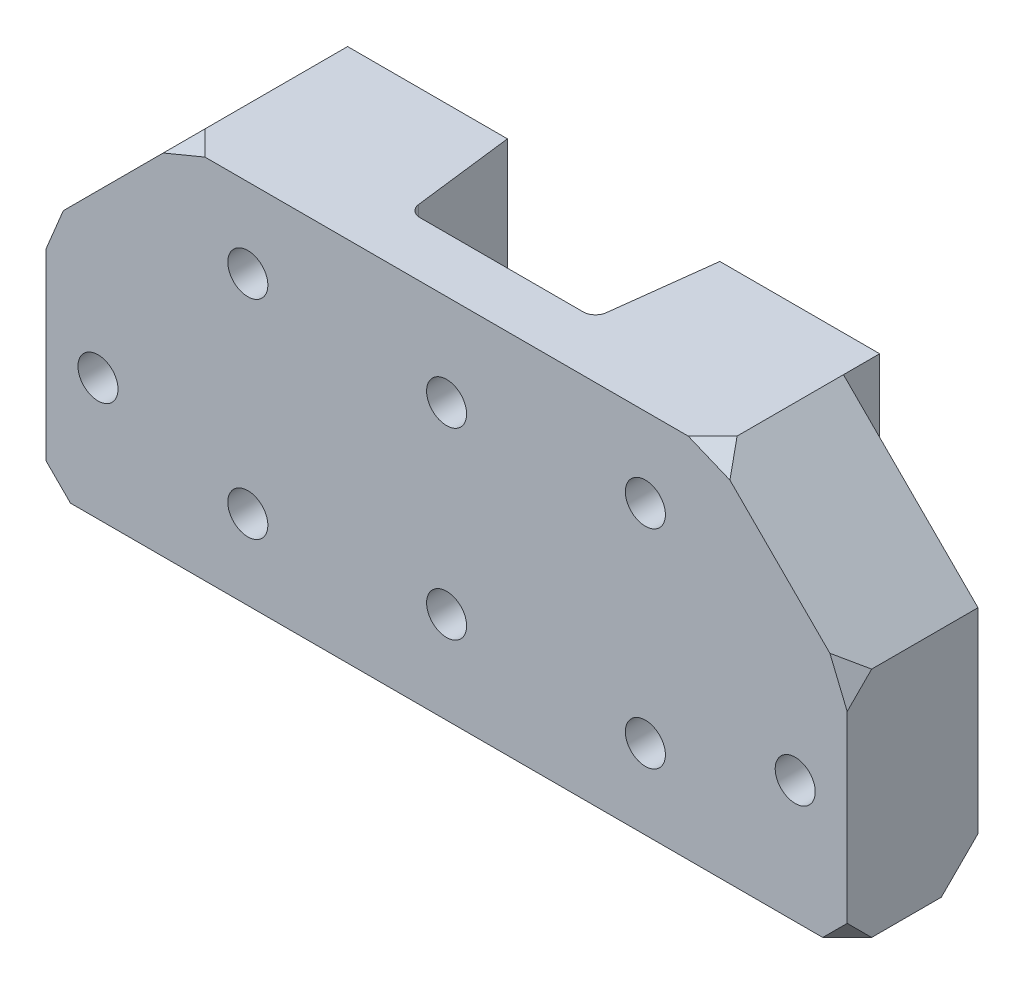
ISO-10303-21;
HEADER;
FILE_DESCRIPTION(('STEP AP214'),'2;1');
FILE_NAME('part.step','',(''),(''),'','','');
FILE_SCHEMA(('AUTOMOTIVE_DESIGN { 1 0 10303 214 1 1 1 1 }'));
ENDSEC;
DATA;
#1=APPLICATION_CONTEXT('core data for automotive mechanical design processes');
#2=APPLICATION_PROTOCOL_DEFINITION('international standard','automotive_design',2000,#1);
#3=PRODUCT_CONTEXT('',#1,'mechanical');
#4=PRODUCT('Part','Part','',(#3));
#5=PRODUCT_RELATED_PRODUCT_CATEGORY('part','',(#4));
#6=PRODUCT_DEFINITION_FORMATION('','',#4);
#7=PRODUCT_DEFINITION_CONTEXT('part definition',#1,'design');
#8=PRODUCT_DEFINITION('design','',#6,#7);
#9=PRODUCT_DEFINITION_SHAPE('','',#8);
#10=(LENGTH_UNIT() NAMED_UNIT(*) SI_UNIT(.MILLI.,.METRE.));
#11=(NAMED_UNIT(*) PLANE_ANGLE_UNIT() SI_UNIT($,.RADIAN.));
#12=(NAMED_UNIT(*) SI_UNIT($,.STERADIAN.) SOLID_ANGLE_UNIT());
#13=UNCERTAINTY_MEASURE_WITH_UNIT(LENGTH_MEASURE(1.E-05),#10,'distance_accuracy_value','');
#14=(GEOMETRIC_REPRESENTATION_CONTEXT(3) GLOBAL_UNCERTAINTY_ASSIGNED_CONTEXT((#13)) GLOBAL_UNIT_ASSIGNED_CONTEXT((#10,
#11,#12)) REPRESENTATION_CONTEXT('',''));
#15=CARTESIAN_POINT('',(0.,0.,0.));
#16=DIRECTION('',(0.,0.,1.));
#17=DIRECTION('',(1.,0.,0.));
#18=AXIS2_PLACEMENT_3D('',#15,#16,#17);
#19=CARTESIAN_POINT('',(84.1301615680965,38.,0.));
#20=DIRECTION('',(-0.707106781186546,-0.707106781186549,0.));
#21=DIRECTION('',(0.,0.,1.));
#22=AXIS2_PLACEMENT_3D('',#19,#20,#21);
#23=PLANE('',#22);
#24=DIRECTION('',(0.,0.,-1.));
#25=VECTOR('',#24,1.);
#26=CARTESIAN_POINT('',(62.1301615680964,60.,0.));
#27=LINE('',#26,#25);
#28=CARTESIAN_POINT('',(62.1301615680964,60.,33.626294368543));
#29=VERTEX_POINT('',#28);
#30=CARTESIAN_POINT('',(62.1301615680965,60.,16.2381471842715));
#31=VERTEX_POINT('',#30);
#32=EDGE_CURVE('E200',#29,#31,#27,.T.);
#33=ORIENTED_EDGE('',*,*,#32,.F.);
#34=DIRECTION('',(-0.500000000000001,0.499999999999999,-0.707106781186548));
#35=VECTOR('',#34,1.);
#36=CARTESIAN_POINT('',(61.2414711810105,60.8886903870859,32.3694963703755));
#37=LINE('',#36,#35);
#38=CARTESIAN_POINT('',(64.9585886928426,57.1715728752538,37.6262943685429));
#39=VERTEX_POINT('',#38);
#40=EDGE_CURVE('E11',#29,#39,#37,.F.);
#41=ORIENTED_EDGE('',*,*,#40,.T.);
#42=DIRECTION('',(0.707106781186549,-0.707106781186546,0.));
#43=VECTOR('',#42,1.);
#44=CARTESIAN_POINT('',(61.0650807840481,61.0650807840483,37.6262943685429));
#45=LINE('',#44,#43);
#46=CARTESIAN_POINT('',(81.3017344433503,40.8284271247462,37.6262943685429));
#47=VERTEX_POINT('',#46);
#48=EDGE_CURVE('E217',#47,#39,#45,.F.);
#49=ORIENTED_EDGE('',*,*,#48,.F.);
#50=DIRECTION('',(0.5,-0.499999999999998,-0.707106781186549));
#51=VECTOR('',#50,1.);
#52=CARTESIAN_POINT('',(96.0188519551824,26.1113096129142,16.8131471842714));
#53=LINE('',#52,#51);
#54=CARTESIAN_POINT('',(84.1301615680965,38.,33.6262943685429));
#55=VERTEX_POINT('',#54);
#56=EDGE_CURVE('E282',#55,#47,#53,.F.);
#57=ORIENTED_EDGE('',*,*,#56,.F.);
#58=DIRECTION('',(0.,0.,1.));
#59=VECTOR('',#58,1.);
#60=CARTESIAN_POINT('',(84.1301615680965,38.,0.));
#61=LINE('',#60,#59);
#62=CARTESIAN_POINT('',(84.1301615680965,38.,16.2381471842715));
#63=VERTEX_POINT('',#62);
#64=EDGE_CURVE('E235',#63,#55,#61,.T.);
#65=ORIENTED_EDGE('',*,*,#64,.F.);
#66=DIRECTION('',(-0.707106781186549,0.707106781186546,0.));
#67=VECTOR('',#66,1.);
#68=CARTESIAN_POINT('',(84.1301615680965,38.,16.2381471842715));
#69=LINE('',#68,#67);
#70=EDGE_CURVE('E209',#31,#63,#69,.F.);
#71=ORIENTED_EDGE('',*,*,#70,.F.);
#72=EDGE_LOOP('',(#33,#41,#49,#57,#65,#71));
#73=FACE_BOUND('',#72,.T.);
#74=ADVANCED_FACE('F40',(#73),#23,.F.);
#75=CARTESIAN_POINT('',(0.,0.,37.6262943685429));
#76=DIRECTION('',(0.,0.,1.));
#77=DIRECTION('',(1.,0.,0.));
#78=AXIS2_PLACEMENT_3D('',#75,#76,#77);
#79=PLANE('',#78);
#80=CARTESIAN_POINT('',(-38.3698384319035,20.,37.6262943685429));
#81=DIRECTION('',(0.,0.,1.));
#82=DIRECTION('',(1.,0.,0.));
#83=AXIS2_PLACEMENT_3D('',#80,#81,#82);
#84=CIRCLE('',#83,3.27500000000001);
#85=CARTESIAN_POINT('',(-35.0948384319035,20.,37.6262943685429));
#86=VERTEX_POINT('',#85);
#87=EDGE_CURVE('E623',#86,#86,#84,.T.);
#88=ORIENTED_EDGE('',*,*,#87,.F.);
#89=EDGE_LOOP('',(#88));
#90=FACE_BOUND('',#89,.T.);
#91=CARTESIAN_POINT('',(75.6301615680965,20.,37.6262943685429));
#92=DIRECTION('',(0.,0.,-1.));
#93=DIRECTION('',(-1.,0.,0.));
#94=AXIS2_PLACEMENT_3D('',#91,#92,#93);
#95=CIRCLE('',#94,3.27500000000001);
#96=CARTESIAN_POINT('',(72.3551615680965,20.,37.6262943685429));
#97=VERTEX_POINT('',#96);
#98=EDGE_CURVE('E548',#97,#97,#95,.T.);
#99=ORIENTED_EDGE('',*,*,#98,.T.);
#100=EDGE_LOOP('',(#99));
#101=FACE_BOUND('',#100,.T.);
#102=CARTESIAN_POINT('',(18.6301615680965,45.,37.6262943685429));
#103=DIRECTION('',(0.,0.,1.));
#104=DIRECTION('',(1.,0.,0.));
#105=AXIS2_PLACEMENT_3D('',#102,#103,#104);
#106=CIRCLE('',#105,3.275);
#107=CARTESIAN_POINT('',(21.9051615680965,45.,37.6262943685429));
#108=VERTEX_POINT('',#107);
#109=EDGE_CURVE('E564',#108,#108,#106,.T.);
#110=ORIENTED_EDGE('',*,*,#109,.F.);
#111=EDGE_LOOP('',(#110));
#112=FACE_BOUND('',#111,.T.);
#113=CARTESIAN_POINT('',(18.6301615680965,15.,37.6262943685429));
#114=DIRECTION('',(0.,0.,1.));
#115=DIRECTION('',(1.,0.,0.));
#116=AXIS2_PLACEMENT_3D('',#113,#114,#115);
#117=CIRCLE('',#116,3.275);
#118=CARTESIAN_POINT('',(21.9051615680965,15.,37.6262943685429));
#119=VERTEX_POINT('',#118);
#120=EDGE_CURVE('E563',#119,#119,#117,.T.);
#121=ORIENTED_EDGE('',*,*,#120,.F.);
#122=EDGE_LOOP('',(#121));
#123=FACE_BOUND('',#122,.T.);
#124=CARTESIAN_POINT('',(51.1301615680965,47.,37.6262943685429));
#125=DIRECTION('',(0.,0.,1.));
#126=DIRECTION('',(1.,0.,0.));
#127=AXIS2_PLACEMENT_3D('',#124,#125,#126);
#128=CIRCLE('',#127,3.275);
#129=CARTESIAN_POINT('',(54.4051615680965,47.,37.6262943685429));
#130=VERTEX_POINT('',#129);
#131=EDGE_CURVE('E583',#130,#130,#128,.T.);
#132=ORIENTED_EDGE('',*,*,#131,.F.);
#133=EDGE_LOOP('',(#132));
#134=FACE_BOUND('',#133,.T.);
#135=CARTESIAN_POINT('',(-13.8698384319035,47.,37.6262943685429));
#136=DIRECTION('',(0.,0.,1.));
#137=DIRECTION('',(1.,0.,0.));
#138=AXIS2_PLACEMENT_3D('',#135,#136,#137);
#139=CIRCLE('',#138,3.275);
#140=CARTESIAN_POINT('',(-10.5948384319035,47.,37.6262943685429));
#141=VERTEX_POINT('',#140);
#142=EDGE_CURVE('E591',#141,#141,#139,.T.);
#143=ORIENTED_EDGE('',*,*,#142,.F.);
#144=EDGE_LOOP('',(#143));
#145=FACE_BOUND('',#144,.T.);
#146=CARTESIAN_POINT('',(-13.8698384319035,13.,37.6262943685429));
#147=DIRECTION('',(0.,0.,1.));
#148=DIRECTION('',(1.,0.,0.));
#149=AXIS2_PLACEMENT_3D('',#146,#147,#148);
#150=CIRCLE('',#149,3.275);
#151=CARTESIAN_POINT('',(-10.5948384319035,13.,37.6262943685429));
#152=VERTEX_POINT('',#151);
#153=EDGE_CURVE('E587',#152,#152,#150,.T.);
#154=ORIENTED_EDGE('',*,*,#153,.F.);
#155=EDGE_LOOP('',(#154));
#156=FACE_BOUND('',#155,.T.);
#157=CARTESIAN_POINT('',(51.1301615680965,13.,37.6262943685429));
#158=DIRECTION('',(0.,0.,1.));
#159=DIRECTION('',(1.,0.,0.));
#160=AXIS2_PLACEMENT_3D('',#157,#158,#159);
#161=CIRCLE('',#160,3.275);
#162=CARTESIAN_POINT('',(54.4051615680965,13.,37.6262943685429));
#163=VERTEX_POINT('',#162);
#164=EDGE_CURVE('E579',#163,#163,#161,.T.);
#165=ORIENTED_EDGE('',*,*,#164,.F.);
#166=EDGE_LOOP('',(#165));
#167=FACE_BOUND('',#166,.T.);
#168=ORIENTED_EDGE('',*,*,#48,.T.);
#169=DIRECTION('',(-0.923879532511287,0.382683432365089,0.));
#170=VECTOR('',#169,1.);
#171=CARTESIAN_POINT('',(29.7261685015092,71.7653191537318,37.6262943685429));
#172=LINE('',#171,#170);
#173=CARTESIAN_POINT('',(58.1301615680964,60.,37.6262943685429));
#174=VERTEX_POINT('',#173);
#175=EDGE_CURVE('E49',#39,#174,#172,.T.);
#176=ORIENTED_EDGE('',*,*,#175,.T.);
#177=DIRECTION('',(-1.,0.,0.));
#178=VECTOR('',#177,1.);
#179=CARTESIAN_POINT('',(62.1301615680965,60.,37.6262943685429));
#180=LINE('',#179,#178);
#181=CARTESIAN_POINT('',(-20.8698384319036,60.,37.6262943685429));
#182=VERTEX_POINT('',#181);
#183=EDGE_CURVE('E61',#174,#182,#180,.T.);
#184=ORIENTED_EDGE('',*,*,#183,.T.);
#185=DIRECTION('',(0.923879532511287,0.38268343236509,0.));
#186=VECTOR('',#185,1.);
#187=CARTESIAN_POINT('',(-24.2695205128149,58.5918055743298,37.6262943685429));
#188=LINE('',#187,#186);
#189=CARTESIAN_POINT('',(-27.6982655566497,57.1715728752539,37.6262943685429));
#190=VERTEX_POINT('',#189);
#191=EDGE_CURVE('E311',#190,#182,#188,.T.);
#192=ORIENTED_EDGE('',*,*,#191,.F.);
#193=DIRECTION('',(0.707106781186546,0.707106781186549,0.));
#194=VECTOR('',#193,1.);
#195=CARTESIAN_POINT('',(-42.4349192159518,42.4349192159517,37.6262943685429));
#196=LINE('',#195,#194);
#197=CARTESIAN_POINT('',(-44.0414113071573,40.8284271247461,37.6262943685429));
#198=VERTEX_POINT('',#197);
#199=EDGE_CURVE('E225',#190,#198,#196,.F.);
#200=ORIENTED_EDGE('',*,*,#199,.T.);
#201=DIRECTION('',(-0.382683432365089,-0.923879532511287,0.));
#202=VECTOR('',#201,1.);
#203=CARTESIAN_POINT('',(-52.0267247902815,21.550175013987,37.6262943685429));
#204=LINE('',#203,#202);
#205=CARTESIAN_POINT('',(-46.8698384319035,33.9999999999999,37.6262943685429));
#206=VERTEX_POINT('',#205);
#207=EDGE_CURVE('E264',#198,#206,#204,.T.);
#208=ORIENTED_EDGE('',*,*,#207,.T.);
#209=DIRECTION('',(0.,-1.,0.));
#210=VECTOR('',#209,1.);
#211=CARTESIAN_POINT('',(-46.8698384319035,0.,37.6262943685429));
#212=LINE('',#211,#210);
#213=CARTESIAN_POINT('',(-46.8698384319035,3.99999999999999,37.6262943685429));
#214=VERTEX_POINT('',#213);
#215=EDGE_CURVE('E622',#206,#214,#212,.T.);
#216=ORIENTED_EDGE('',*,*,#215,.T.);
#217=DIRECTION('',(0.707106781186548,-0.707106781186547,0.));
#218=VECTOR('',#217,1.);
#219=CARTESIAN_POINT('',(-21.4349192159518,-21.4349192159518,37.6262943685429));
#220=LINE('',#219,#218);
#221=CARTESIAN_POINT('',(-42.8698384319035,0.,37.6262943685429));
#222=VERTEX_POINT('',#221);
#223=EDGE_CURVE('E253',#214,#222,#220,.T.);
#224=ORIENTED_EDGE('',*,*,#223,.T.);
#225=DIRECTION('',(1.,0.,0.));
#226=VECTOR('',#225,1.);
#227=CARTESIAN_POINT('',(-24.8698384319035,0.,37.6262943685429));
#228=LINE('',#227,#226);
#229=CARTESIAN_POINT('',(80.1301615680965,0.,37.6262943685429));
#230=VERTEX_POINT('',#229);
#231=EDGE_CURVE('E595',#222,#230,#228,.T.);
#232=ORIENTED_EDGE('',*,*,#231,.T.);
#233=DIRECTION('',(0.707106781186548,0.707106781186547,0.));
#234=VECTOR('',#233,1.);
#235=CARTESIAN_POINT('',(40.0650807840482,-40.0650807840482,37.6262943685429));
#236=LINE('',#235,#234);
#237=CARTESIAN_POINT('',(84.1301615680965,4.00000000000002,37.626294368543));
#238=VERTEX_POINT('',#237);
#239=EDGE_CURVE('E245',#230,#238,#236,.T.);
#240=ORIENTED_EDGE('',*,*,#239,.T.);
#241=DIRECTION('',(0.,-1.,0.));
#242=VECTOR('',#241,1.);
#243=CARTESIAN_POINT('',(84.1301615680965,0.,37.6262943685429));
#244=LINE('',#243,#242);
#245=CARTESIAN_POINT('',(84.1301615680965,34.,37.6262943685429));
#246=VERTEX_POINT('',#245);
#247=EDGE_CURVE('E547',#246,#238,#244,.T.);
#248=ORIENTED_EDGE('',*,*,#247,.F.);
#249=DIRECTION('',(0.38268343236509,-0.923879532511287,0.));
#250=VECTOR('',#249,1.);
#251=CARTESIAN_POINT('',(83.83039993778,34.7236885933891,37.6262943685429));
#252=LINE('',#251,#250);
#253=EDGE_CURVE('E275',#47,#246,#252,.T.);
#254=ORIENTED_EDGE('',*,*,#253,.F.);
#255=EDGE_LOOP('',(#168,#176,#184,#192,#200,#208,#216,#224,#232,#240,#248,#254));
#256=FACE_BOUND('',#255,.T.);
#257=ADVANCED_FACE('F316',(#90,#101,#112,#123,#134,#145,#156,#167,#256),#79,.T.);
#258=CARTESIAN_POINT('',(0.,60.,0.));
#259=DIRECTION('',(0.,-1.,0.));
#260=DIRECTION('',(0.,0.,-1.));
#261=AXIS2_PLACEMENT_3D('',#258,#259,#260);
#262=PLANE('',#261);
#263=DIRECTION('',(-0.707106781186548,0.,0.707106781186548));
#264=VECTOR('',#263,1.);
#265=CARTESIAN_POINT('',(47.8782279683197,60.,47.8782279683197));
#266=LINE('',#265,#264);
#267=EDGE_CURVE('E194',#29,#174,#266,.T.);
#268=ORIENTED_EDGE('',*,*,#267,.F.);
#269=ORIENTED_EDGE('',*,*,#32,.T.);
#270=DIRECTION('',(0.,0.,-1.));
#271=VECTOR('',#270,1.);
#272=CARTESIAN_POINT('',(62.1301615680965,60.,95.5324756032248));
#273=LINE('',#272,#271);
#274=CARTESIAN_POINT('',(62.1301615680965,60.,10.3131471842715));
#275=VERTEX_POINT('',#274);
#276=EDGE_CURVE('E453',#31,#275,#273,.T.);
#277=ORIENTED_EDGE('',*,*,#276,.T.);
#278=DIRECTION('',(1.,0.,0.));
#279=VECTOR('',#278,1.);
#280=CARTESIAN_POINT('',(-2.86983843190352,60.,10.3131471842715));
#281=LINE('',#280,#279);
#282=CARTESIAN_POINT('',(35.9940278876453,60.,10.3131471842715));
#283=VERTEX_POINT('',#282);
#284=EDGE_CURVE('E457',#283,#275,#281,.T.);
#285=ORIENTED_EDGE('',*,*,#284,.F.);
#286=DIRECTION('',(-0.121869343405151,0.,0.992546151641322));
#287=VECTOR('',#286,1.);
#288=CARTESIAN_POINT('',(36.970576623517,60.0000000000001,2.35979597553153));
#289=LINE('',#288,#287);
#290=CARTESIAN_POINT('',(33.961097926045,60.0000000000001,26.8700330553532));
#291=VERTEX_POINT('',#290);
#292=EDGE_CURVE('E486',#283,#291,#289,.T.);
#293=ORIENTED_EDGE('',*,*,#292,.T.);
#294=CARTESIAN_POINT('',(31.9760056227623,60.0000000000001,26.6262943685429));
#295=DIRECTION('',(0.,-1.,0.));
#296=DIRECTION('',(0.,0.,-1.));
#297=AXIS2_PLACEMENT_3D('',#294,#295,#296);
#298=CIRCLE('',#297,2.);
#299=CARTESIAN_POINT('',(31.9760056227623,60.0000000000001,28.626294368543));
#300=VERTEX_POINT('',#299);
#301=EDGE_CURVE('E489',#291,#300,#298,.T.);
#302=ORIENTED_EDGE('',*,*,#301,.T.);
#303=DIRECTION('',(-1.,0.,0.));
#304=VECTOR('',#303,1.);
#305=CARTESIAN_POINT('',(5.28431751343065,60.0000000000001,28.6262943685429));
#306=LINE('',#305,#304);
#307=CARTESIAN_POINT('',(5.28431751343065,60.0000000000001,28.6262943685429));
#308=VERTEX_POINT('',#307);
#309=EDGE_CURVE('E493',#300,#308,#306,.T.);
#310=ORIENTED_EDGE('',*,*,#309,.T.);
#311=CARTESIAN_POINT('',(5.28431751343064,60.0000000000001,26.6262943685429));
#312=DIRECTION('',(0.,-1.,0.));
#313=DIRECTION('',(0.,0.,-1.));
#314=AXIS2_PLACEMENT_3D('',#311,#312,#313);
#315=CIRCLE('',#314,2.);
#316=CARTESIAN_POINT('',(3.29922521014799,60.0000000000001,26.8700330553532));
#317=VERTEX_POINT('',#316);
#318=EDGE_CURVE('E497',#308,#317,#315,.T.);
#319=ORIENTED_EDGE('',*,*,#318,.T.);
#320=DIRECTION('',(-0.121869343405144,0.,-0.992546151641323));
#321=VECTOR('',#320,1.);
#322=CARTESIAN_POINT('',(0.298191513608607,60.0000000000001,2.42857498871066));
#323=LINE('',#322,#321);
#324=CARTESIAN_POINT('',(1.26629524854777,60.0000000000001,10.3131471842715));
#325=VERTEX_POINT('',#324);
#326=EDGE_CURVE('E501',#317,#325,#323,.T.);
#327=ORIENTED_EDGE('',*,*,#326,.T.);
#328=CARTESIAN_POINT('',(-24.8698384319035,60.,10.3131471842715));
#329=VERTEX_POINT('',#328);
#330=EDGE_CURVE('E428',#329,#325,#281,.T.);
#331=ORIENTED_EDGE('',*,*,#330,.F.);
#332=DIRECTION('',(0.,0.,-1.));
#333=VECTOR('',#332,1.);
#334=CARTESIAN_POINT('',(-24.8698384319035,60.,95.5324756032248));
#335=LINE('',#334,#333);
#336=CARTESIAN_POINT('',(-24.8698384319035,60.,16.2381471842715));
#337=VERTEX_POINT('',#336);
#338=EDGE_CURVE('E426',#337,#329,#335,.T.);
#339=ORIENTED_EDGE('',*,*,#338,.F.);
#340=DIRECTION('',(0.,0.,1.));
#341=VECTOR('',#340,1.);
#342=CARTESIAN_POINT('',(-24.8698384319035,60.,0.));
#343=LINE('',#342,#341);
#344=CARTESIAN_POINT('',(-24.8698384319035,60.,33.626294368543));
#345=VERTEX_POINT('',#344);
#346=EDGE_CURVE('E211',#337,#345,#343,.T.);
#347=ORIENTED_EDGE('',*,*,#346,.T.);
#348=DIRECTION('',(0.707106781186548,0.,0.707106781186547));
#349=VECTOR('',#348,1.);
#350=CARTESIAN_POINT('',(-29.2480664002233,60.,29.2480664002233));
#351=LINE('',#350,#349);
#352=EDGE_CURVE('E204',#345,#182,#351,.T.);
#353=ORIENTED_EDGE('',*,*,#352,.T.);
#354=ORIENTED_EDGE('',*,*,#183,.F.);
#355=EDGE_LOOP('',(#268,#269,#277,#285,#293,#302,#310,#319,#327,#331,#339,#347,#353,#354));
#356=FACE_BOUND('',#355,.T.);
#357=ADVANCED_FACE('F199',(#356),#262,.F.);
#358=CARTESIAN_POINT('',(-46.8698384319035,0.,16.2381471842715));
#359=DIRECTION('',(0.,0.,-1.));
#360=DIRECTION('',(-1.,0.,0.));
#361=AXIS2_PLACEMENT_3D('',#358,#359,#360);
#362=PLANE('',#361);
#363=CARTESIAN_POINT('',(-38.3698384319035,20.,16.2381471842715));
#364=DIRECTION('',(0.,0.,1.));
#365=DIRECTION('',(1.,0.,0.));
#366=AXIS2_PLACEMENT_3D('',#363,#364,#365);
#367=CIRCLE('',#366,3.27500000000001);
#368=CARTESIAN_POINT('',(-35.0948384319035,20.,16.2381471842715));
#369=VERTEX_POINT('',#368);
#370=EDGE_CURVE('E630',#369,#369,#367,.T.);
#371=ORIENTED_EDGE('',*,*,#370,.T.);
#372=EDGE_LOOP('',(#371));
#373=FACE_BOUND('',#372,.T.);
#374=DIRECTION('',(1.,0.,0.));
#375=VECTOR('',#374,1.);
#376=CARTESIAN_POINT('',(-46.8698384319035,0.,16.2381471842715));
#377=LINE('',#376,#375);
#378=CARTESIAN_POINT('',(-40.8698384319035,0.,16.2381471842715));
#379=VERTEX_POINT('',#378);
#380=CARTESIAN_POINT('',(-24.8698384319035,0.,16.2381471842715));
#381=VERTEX_POINT('',#380);
#382=EDGE_CURVE('E614',#379,#381,#377,.T.);
#383=ORIENTED_EDGE('',*,*,#382,.F.);
#384=DIRECTION('',(-0.707106781186547,0.707106781186548,0.));
#385=VECTOR('',#384,1.);
#386=CARTESIAN_POINT('',(-43.8698384319035,3.00000000000001,16.2381471842715));
#387=LINE('',#386,#385);
#388=CARTESIAN_POINT('',(-46.8698384319035,6.00000000000002,16.2381471842715));
#389=VERTEX_POINT('',#388);
#390=EDGE_CURVE('E300',#379,#389,#387,.T.);
#391=ORIENTED_EDGE('',*,*,#390,.T.);
#392=DIRECTION('',(0.,1.,0.));
#393=VECTOR('',#392,1.);
#394=CARTESIAN_POINT('',(-46.8698384319035,0.,16.2381471842715));
#395=LINE('',#394,#393);
#396=CARTESIAN_POINT('',(-46.8698384319035,38.,16.2381471842715));
#397=VERTEX_POINT('',#396);
#398=EDGE_CURVE('E627',#389,#397,#395,.T.);
#399=ORIENTED_EDGE('',*,*,#398,.T.);
#400=DIRECTION('',(-0.707106781186546,-0.707106781186549,0.));
#401=VECTOR('',#400,1.);
#402=CARTESIAN_POINT('',(-65.8698384319035,18.9999999999999,16.2381471842715));
#403=LINE('',#402,#401);
#404=EDGE_CURVE('E232',#397,#337,#403,.F.);
#405=ORIENTED_EDGE('',*,*,#404,.T.);
#406=DIRECTION('',(0.,1.,0.));
#407=VECTOR('',#406,1.);
#408=CARTESIAN_POINT('',(-24.8698384319035,0.,16.2381471842715));
#409=LINE('',#408,#407);
#410=EDGE_CURVE('E612',#381,#337,#409,.T.);
#411=ORIENTED_EDGE('',*,*,#410,.F.);
#412=EDGE_LOOP('',(#383,#391,#399,#405,#411));
#413=FACE_BOUND('',#412,.T.);
#414=ADVANCED_FACE('F349',(#373,#413),#362,.T.);
#415=CARTESIAN_POINT('',(12.657693959334,0.,2.96357615590343));
#416=DIRECTION('',(0.,-1.,0.));
#417=DIRECTION('',(0.,0.,-1.));
#418=AXIS2_PLACEMENT_3D('',#415,#416,#417);
#419=PLANE('',#418);
#420=DIRECTION('',(0.,0.,-1.));
#421=VECTOR('',#420,1.);
#422=CARTESIAN_POINT('',(-46.8698384319035,0.,37.6262943685429));
#423=LINE('',#422,#421);
#424=CARTESIAN_POINT('',(-46.8698384319035,0.,33.626294368543));
#425=VERTEX_POINT('',#424);
#426=CARTESIAN_POINT('',(-46.8698384319035,0.,22.2381471842715));
#427=VERTEX_POINT('',#426);
#428=EDGE_CURVE('E619',#425,#427,#423,.T.);
#429=ORIENTED_EDGE('',*,*,#428,.T.);
#430=DIRECTION('',(0.707106781186548,0.,-0.707106781186548));
#431=VECTOR('',#430,1.);
#432=CARTESIAN_POINT('',(-7.46878672210072,0.,-17.1629045255313));
#433=LINE('',#432,#431);
#434=EDGE_CURVE('E297',#427,#379,#433,.T.);
#435=ORIENTED_EDGE('',*,*,#434,.T.);
#436=ORIENTED_EDGE('',*,*,#382,.T.);
#437=DIRECTION('',(0.,0.,-1.));
#438=VECTOR('',#437,1.);
#439=CARTESIAN_POINT('',(-24.8698384319035,0.,95.5324756032248));
#440=LINE('',#439,#438);
#441=CARTESIAN_POINT('',(-24.8698384319035,0.,10.3131471842715));
#442=VERTEX_POINT('',#441);
#443=EDGE_CURVE('E434',#381,#442,#440,.T.);
#444=ORIENTED_EDGE('',*,*,#443,.T.);
#445=DIRECTION('',(1.,0.,0.));
#446=VECTOR('',#445,1.);
#447=CARTESIAN_POINT('',(-2.86983843190352,0.,10.3131471842715));
#448=LINE('',#447,#446);
#449=CARTESIAN_POINT('',(1.26629524854777,0.,10.3131471842715));
#450=VERTEX_POINT('',#449);
#451=EDGE_CURVE('E460',#442,#450,#448,.T.);
#452=ORIENTED_EDGE('',*,*,#451,.T.);
#453=DIRECTION('',(0.121869343405145,0.,0.992546151641322));
#454=VECTOR('',#453,1.);
#455=CARTESIAN_POINT('',(0.298191513608603,0.,2.42857498871065));
#456=LINE('',#455,#454);
#457=CARTESIAN_POINT('',(3.29922521014799,0.,26.8700330553532));
#458=VERTEX_POINT('',#457);
#459=EDGE_CURVE('E219',#450,#458,#456,.T.);
#460=ORIENTED_EDGE('',*,*,#459,.T.);
#461=CARTESIAN_POINT('',(5.28431751343064,0.,26.6262943685429));
#462=DIRECTION('',(0.,-1.,0.));
#463=DIRECTION('',(0.,0.,-1.));
#464=AXIS2_PLACEMENT_3D('',#461,#462,#463);
#465=CIRCLE('',#464,2.);
#466=CARTESIAN_POINT('',(5.28431751343065,0.,28.6262943685429));
#467=VERTEX_POINT('',#466);
#468=EDGE_CURVE('E516',#458,#467,#465,.F.);
#469=ORIENTED_EDGE('',*,*,#468,.T.);
#470=DIRECTION('',(1.,0.,0.));
#471=VECTOR('',#470,1.);
#472=CARTESIAN_POINT('',(12.657693959334,0.,28.6262943685429));
#473=LINE('',#472,#471);
#474=CARTESIAN_POINT('',(31.9760056227623,0.,28.626294368543));
#475=VERTEX_POINT('',#474);
#476=EDGE_CURVE('E512',#467,#475,#473,.T.);
#477=ORIENTED_EDGE('',*,*,#476,.T.);
#478=CARTESIAN_POINT('',(31.9760056227623,0.,26.6262943685429));
#479=DIRECTION('',(0.,-1.,0.));
#480=DIRECTION('',(0.,0.,-1.));
#481=AXIS2_PLACEMENT_3D('',#478,#479,#480);
#482=CIRCLE('',#481,2.00000000000001);
#483=CARTESIAN_POINT('',(33.961097926045,0.,26.8700330553532));
#484=VERTEX_POINT('',#483);
#485=EDGE_CURVE('E508',#475,#484,#482,.F.);
#486=ORIENTED_EDGE('',*,*,#485,.T.);
#487=DIRECTION('',(0.121869343405151,0.,-0.992546151641322));
#488=VECTOR('',#487,1.);
#489=CARTESIAN_POINT('',(33.961097926045,0.,26.8700330553533));
#490=LINE('',#489,#488);
#491=CARTESIAN_POINT('',(35.9940278876453,0.,10.3131471842715));
#492=VERTEX_POINT('',#491);
#493=EDGE_CURVE('E504',#484,#492,#490,.T.);
#494=ORIENTED_EDGE('',*,*,#493,.T.);
#495=CARTESIAN_POINT('',(62.1301615680965,0.,10.3131471842715));
#496=VERTEX_POINT('',#495);
#497=EDGE_CURVE('E465',#492,#496,#448,.T.);
#498=ORIENTED_EDGE('',*,*,#497,.T.);
#499=DIRECTION('',(0.,0.,-1.));
#500=VECTOR('',#499,1.);
#501=CARTESIAN_POINT('',(62.1301615680965,0.,95.5324756032248));
#502=LINE('',#501,#500);
#503=CARTESIAN_POINT('',(62.1301615680965,0.,16.2381471842715));
#504=VERTEX_POINT('',#503);
#505=EDGE_CURVE('E454',#504,#496,#502,.T.);
#506=ORIENTED_EDGE('',*,*,#505,.F.);
#507=DIRECTION('',(-1.,0.,0.));
#508=VECTOR('',#507,1.);
#509=CARTESIAN_POINT('',(84.1301615680965,0.,16.2381471842715));
#510=LINE('',#509,#508);
#511=CARTESIAN_POINT('',(78.1301615680965,0.,16.2381471842715));
#512=VERTEX_POINT('',#511);
#513=EDGE_CURVE('E560',#512,#504,#510,.T.);
#514=ORIENTED_EDGE('',*,*,#513,.F.);
#515=DIRECTION('',(0.707106781186548,0.,0.707106781186547));
#516=VECTOR('',#515,1.);
#517=CARTESIAN_POINT('',(38.7566422495311,0.,-23.1353721342938));
#518=LINE('',#517,#516);
#519=CARTESIAN_POINT('',(84.1301615680965,0.,22.2381471842715));
#520=VERTEX_POINT('',#519);
#521=EDGE_CURVE('E290',#512,#520,#518,.T.);
#522=ORIENTED_EDGE('',*,*,#521,.T.);
#523=DIRECTION('',(0.,0.,-1.));
#524=VECTOR('',#523,1.);
#525=CARTESIAN_POINT('',(84.1301615680965,0.,37.6262943685429));
#526=LINE('',#525,#524);
#527=CARTESIAN_POINT('',(84.1301615680965,0.,33.6262943685429));
#528=VERTEX_POINT('',#527);
#529=EDGE_CURVE('E552',#528,#520,#526,.T.);
#530=ORIENTED_EDGE('',*,*,#529,.F.);
#531=DIRECTION('',(-0.707106781186548,0.,0.707106781186547));
#532=VECTOR('',#531,1.);
#533=CARTESIAN_POINT('',(63.7252868700349,0.,54.0311690666044));
#534=LINE('',#533,#532);
#535=EDGE_CURVE('E241',#528,#230,#534,.T.);
#536=ORIENTED_EDGE('',*,*,#535,.T.);
#537=ORIENTED_EDGE('',*,*,#231,.F.);
#538=DIRECTION('',(-0.707106781186548,0.,-0.707106781186547));
#539=VECTOR('',#538,1.);
#540=CARTESIAN_POINT('',(-32.4374313426045,0.,48.058701457842));
#541=LINE('',#540,#539);
#542=EDGE_CURVE('E256',#222,#425,#541,.T.);
#543=ORIENTED_EDGE('',*,*,#542,.T.);
#544=EDGE_LOOP('',(#429,#435,#436,#444,#452,#460,#469,#477,#486,#494,#498,#506,#514,#522,#530,
#536,#537,#543));
#545=FACE_BOUND('',#544,.T.);
#546=ADVANCED_FACE('F407',(#545),#419,.T.);
#547=CARTESIAN_POINT('',(84.1301615680965,0.,0.));
#548=DIRECTION('',(-1.,0.,0.));
#549=DIRECTION('',(0.,0.,1.));
#550=AXIS2_PLACEMENT_3D('',#547,#548,#549);
#551=PLANE('',#550);
#552=DIRECTION('',(0.,-0.707106781186548,0.707106781186547));
#553=VECTOR('',#552,1.);
#554=CARTESIAN_POINT('',(84.1301615680965,11.1190735921357,11.1190735921357));
#555=LINE('',#554,#553);
#556=CARTESIAN_POINT('',(84.1301615680965,5.99999999999998,16.2381471842715));
#557=VERTEX_POINT('',#556);
#558=EDGE_CURVE('E286',#557,#520,#555,.T.);
#559=ORIENTED_EDGE('',*,*,#558,.F.);
#560=DIRECTION('',(0.,1.,0.));
#561=VECTOR('',#560,1.);
#562=CARTESIAN_POINT('',(84.1301615680965,0.,16.2381471842715));
#563=LINE('',#562,#561);
#564=EDGE_CURVE('E324',#557,#63,#563,.T.);
#565=ORIENTED_EDGE('',*,*,#564,.T.);
#566=ORIENTED_EDGE('',*,*,#64,.T.);
#567=DIRECTION('',(0.,-0.707106781186548,0.707106781186547));
#568=VECTOR('',#567,1.);
#569=CARTESIAN_POINT('',(84.1301615680965,35.8131471842714,35.8131471842715));
#570=LINE('',#569,#568);
#571=EDGE_CURVE('E279',#55,#246,#570,.T.);
#572=ORIENTED_EDGE('',*,*,#571,.T.);
#573=ORIENTED_EDGE('',*,*,#247,.T.);
#574=DIRECTION('',(0.,0.707106781186548,0.707106781186547));
#575=VECTOR('',#574,1.);
#576=CARTESIAN_POINT('',(84.1301615680965,-16.8131471842715,16.8131471842715));
#577=LINE('',#576,#575);
#578=EDGE_CURVE('E249',#528,#238,#577,.T.);
#579=ORIENTED_EDGE('',*,*,#578,.F.);
#580=ORIENTED_EDGE('',*,*,#529,.T.);
#581=EDGE_LOOP('',(#559,#565,#566,#572,#573,#579,#580));
#582=FACE_BOUND('',#581,.T.);
#583=ADVANCED_FACE('F323',(#582),#551,.F.);
#584=CARTESIAN_POINT('',(-24.8698384319035,60.,0.));
#585=DIRECTION('',(0.707106781186549,-0.707106781186547,0.));
#586=DIRECTION('',(0.,0.,1.));
#587=AXIS2_PLACEMENT_3D('',#584,#585,#586);
#588=PLANE('',#587);
#589=DIRECTION('',(0.499999999999999,0.5,-0.707106781186548));
#590=VECTOR('',#589,1.);
#591=CARTESIAN_POINT('',(-12.9811480448177,71.8886903870859,16.8131471842715));
#592=LINE('',#591,#590);
#593=EDGE_CURVE('E308',#345,#190,#592,.F.);
#594=ORIENTED_EDGE('',*,*,#593,.F.);
#595=ORIENTED_EDGE('',*,*,#346,.F.);
#596=ORIENTED_EDGE('',*,*,#404,.F.);
#597=DIRECTION('',(0.,0.,-1.));
#598=VECTOR('',#597,1.);
#599=CARTESIAN_POINT('',(-46.8698384319035,38.,0.));
#600=LINE('',#599,#598);
#601=CARTESIAN_POINT('',(-46.8698384319035,38.,33.626294368543));
#602=VERTEX_POINT('',#601);
#603=EDGE_CURVE('E228',#602,#397,#600,.T.);
#604=ORIENTED_EDGE('',*,*,#603,.F.);
#605=DIRECTION('',(-0.499999999999999,-0.500000000000001,-0.707106781186548));
#606=VECTOR('',#605,1.);
#607=CARTESIAN_POINT('',(-47.7585288189894,37.1113096129141,32.3694963703755));
#608=LINE('',#607,#606);
#609=EDGE_CURVE('E271',#602,#198,#608,.F.);
#610=ORIENTED_EDGE('',*,*,#609,.T.);
#611=ORIENTED_EDGE('',*,*,#199,.F.);
#612=EDGE_LOOP('',(#594,#595,#596,#604,#610,#611));
#613=FACE_BOUND('',#612,.T.);
#614=ADVANCED_FACE('F370',(#613),#588,.F.);
#615=CARTESIAN_POINT('',(-24.8698384319035,0.,95.5324756032248));
#616=DIRECTION('',(-1.,0.,0.));
#617=DIRECTION('',(0.,-1.,0.));
#618=AXIS2_PLACEMENT_3D('',#615,#616,#617);
#619=PLANE('',#618);
#620=ORIENTED_EDGE('',*,*,#443,.F.);
#621=ORIENTED_EDGE('',*,*,#410,.T.);
#622=ORIENTED_EDGE('',*,*,#338,.T.);
#623=DIRECTION('',(0.,1.,0.));
#624=VECTOR('',#623,1.);
#625=CARTESIAN_POINT('',(-24.8698384319035,0.,10.3131471842715));
#626=LINE('',#625,#624);
#627=EDGE_CURVE('E441',#442,#329,#626,.T.);
#628=ORIENTED_EDGE('',*,*,#627,.F.);
#629=EDGE_LOOP('',(#620,#621,#622,#628));
#630=FACE_BOUND('',#629,.T.);
#631=ADVANCED_FACE('F366',(#630),#619,.T.);
#632=CARTESIAN_POINT('',(0.298191513608605,2133.6,2.42857498871065));
#633=DIRECTION('',(0.992546151641322,0.,-0.121869343405144));
#634=DIRECTION('',(-0.121869343405145,0.,-0.992546151641323));
#635=AXIS2_PLACEMENT_3D('',#632,#633,#634);
#636=PLANE('',#635);
#637=DIRECTION('',(0.,-1.,0.));
#638=VECTOR('',#637,1.);
#639=CARTESIAN_POINT('',(1.26629524854777,2133.6,10.3131471842715));
#640=LINE('',#639,#638);
#641=EDGE_CURVE('E464',#325,#450,#640,.T.);
#642=ORIENTED_EDGE('',*,*,#641,.F.);
#643=ORIENTED_EDGE('',*,*,#326,.F.);
#644=DIRECTION('',(0.,-1.,0.));
#645=VECTOR('',#644,1.);
#646=CARTESIAN_POINT('',(3.29922521014799,2133.6,26.8700330553532));
#647=LINE('',#646,#645);
#648=EDGE_CURVE('E482',#317,#458,#647,.T.);
#649=ORIENTED_EDGE('',*,*,#648,.T.);
#650=ORIENTED_EDGE('',*,*,#459,.F.);
#651=EDGE_LOOP('',(#642,#643,#649,#650));
#652=FACE_BOUND('',#651,.T.);
#653=ADVANCED_FACE('F369',(#652),#636,.T.);
#654=CARTESIAN_POINT('',(5.28431751343064,2133.6,26.6262943685429));
#655=DIRECTION('',(0.,-1.,0.));
#656=DIRECTION('',(0.,0.,-1.));
#657=AXIS2_PLACEMENT_3D('',#654,#655,#656);
#658=CYLINDRICAL_SURFACE('',#657,2.);
#659=ORIENTED_EDGE('',*,*,#318,.F.);
#660=DIRECTION('',(0.,-1.,0.));
#661=VECTOR('',#660,1.);
#662=CARTESIAN_POINT('',(5.28431751343065,2133.6,28.6262943685429));
#663=LINE('',#662,#661);
#664=EDGE_CURVE('E478',#308,#467,#663,.T.);
#665=ORIENTED_EDGE('',*,*,#664,.T.);
#666=ORIENTED_EDGE('',*,*,#468,.F.);
#667=ORIENTED_EDGE('',*,*,#648,.F.);
#668=EDGE_LOOP('',(#659,#665,#666,#667));
#669=FACE_BOUND('',#668,.T.);
#670=ADVANCED_FACE('F399',(#669),#658,.F.);
#671=CARTESIAN_POINT('',(5.28431751343065,2133.6,28.6262943685429));
#672=DIRECTION('',(0.,0.,-1.));
#673=DIRECTION('',(-1.,0.,0.));
#674=AXIS2_PLACEMENT_3D('',#671,#672,#673);
#675=PLANE('',#674);
#676=CARTESIAN_POINT('',(18.6301615680965,45.,28.626294368543));
#677=DIRECTION('',(0.,0.,-1.));
#678=DIRECTION('',(-1.,0.,0.));
#679=AXIS2_PLACEMENT_3D('',#676,#677,#678);
#680=CIRCLE('',#679,3.275);
#681=CARTESIAN_POINT('',(15.3551615680965,45.,28.626294368543));
#682=VERTEX_POINT('',#681);
#683=EDGE_CURVE('E575',#682,#682,#680,.T.);
#684=ORIENTED_EDGE('',*,*,#683,.F.);
#685=EDGE_LOOP('',(#684));
#686=FACE_BOUND('',#685,.T.);
#687=CARTESIAN_POINT('',(18.6301615680965,15.,28.626294368543));
#688=DIRECTION('',(0.,0.,-1.));
#689=DIRECTION('',(-1.,0.,0.));
#690=AXIS2_PLACEMENT_3D('',#687,#688,#689);
#691=CIRCLE('',#690,3.275);
#692=CARTESIAN_POINT('',(15.3551615680965,15.,28.626294368543));
#693=VERTEX_POINT('',#692);
#694=EDGE_CURVE('E568',#693,#693,#691,.T.);
#695=ORIENTED_EDGE('',*,*,#694,.F.);
#696=EDGE_LOOP('',(#695));
#697=FACE_BOUND('',#696,.T.);
#698=ORIENTED_EDGE('',*,*,#309,.F.);
#699=DIRECTION('',(0.,-1.,0.));
#700=VECTOR('',#699,1.);
#701=CARTESIAN_POINT('',(31.9760056227623,2133.6,28.626294368543));
#702=LINE('',#701,#700);
#703=EDGE_CURVE('E474',#300,#475,#702,.T.);
#704=ORIENTED_EDGE('',*,*,#703,.T.);
#705=ORIENTED_EDGE('',*,*,#476,.F.);
#706=ORIENTED_EDGE('',*,*,#664,.F.);
#707=EDGE_LOOP('',(#698,#704,#705,#706));
#708=FACE_BOUND('',#707,.T.);
#709=ADVANCED_FACE('F395',(#686,#697,#708),#675,.T.);
#710=CARTESIAN_POINT('',(31.9760056227623,2133.6,26.6262943685429));
#711=DIRECTION('',(0.,-1.,0.));
#712=DIRECTION('',(0.,0.,-1.));
#713=AXIS2_PLACEMENT_3D('',#710,#711,#712);
#714=CYLINDRICAL_SURFACE('',#713,2.00000000000001);
#715=ORIENTED_EDGE('',*,*,#301,.F.);
#716=DIRECTION('',(0.,-1.,0.));
#717=VECTOR('',#716,1.);
#718=CARTESIAN_POINT('',(33.961097926045,2133.6,26.8700330553532));
#719=LINE('',#718,#717);
#720=EDGE_CURVE('E470',#291,#484,#719,.T.);
#721=ORIENTED_EDGE('',*,*,#720,.T.);
#722=ORIENTED_EDGE('',*,*,#485,.F.);
#723=ORIENTED_EDGE('',*,*,#703,.F.);
#724=EDGE_LOOP('',(#715,#721,#722,#723));
#725=FACE_BOUND('',#724,.T.);
#726=ADVANCED_FACE('F391',(#725),#714,.F.);
#727=CARTESIAN_POINT('',(33.961097926045,2133.6,26.8700330553532));
#728=DIRECTION('',(-0.992546151641322,0.,-0.121869343405151));
#729=DIRECTION('',(-0.121869343405151,0.,0.992546151641322));
#730=AXIS2_PLACEMENT_3D('',#727,#728,#729);
#731=PLANE('',#730);
#732=DIRECTION('',(0.,1.,0.));
#733=VECTOR('',#732,1.);
#734=CARTESIAN_POINT('',(35.9940278876453,2133.6,10.3131471842715));
#735=LINE('',#734,#733);
#736=EDGE_CURVE('E212',#492,#283,#735,.T.);
#737=ORIENTED_EDGE('',*,*,#736,.F.);
#738=ORIENTED_EDGE('',*,*,#493,.F.);
#739=ORIENTED_EDGE('',*,*,#720,.F.);
#740=ORIENTED_EDGE('',*,*,#292,.F.);
#741=EDGE_LOOP('',(#737,#738,#739,#740));
#742=FACE_BOUND('',#741,.T.);
#743=ADVANCED_FACE('F387',(#742),#731,.T.);
#744=CARTESIAN_POINT('',(-2.86983843190352,0.,10.3131471842715));
#745=DIRECTION('',(0.,0.,1.));
#746=DIRECTION('',(1.,0.,0.));
#747=AXIS2_PLACEMENT_3D('',#744,#745,#746);
#748=PLANE('',#747);
#749=ORIENTED_EDGE('',*,*,#736,.T.);
#750=ORIENTED_EDGE('',*,*,#284,.T.);
#751=DIRECTION('',(0.,-1.,0.));
#752=VECTOR('',#751,1.);
#753=CARTESIAN_POINT('',(62.1301615680965,0.,10.3131471842715));
#754=LINE('',#753,#752);
#755=EDGE_CURVE('E449',#275,#496,#754,.T.);
#756=ORIENTED_EDGE('',*,*,#755,.T.);
#757=ORIENTED_EDGE('',*,*,#497,.F.);
#758=EDGE_LOOP('',(#749,#750,#756,#757));
#759=FACE_BOUND('',#758,.T.);
#760=CARTESIAN_POINT('',(51.1301615680965,13.,10.3131471842715));
#761=DIRECTION('',(0.,0.,-1.));
#762=DIRECTION('',(-1.,0.,0.));
#763=AXIS2_PLACEMENT_3D('',#760,#761,#762);
#764=CIRCLE('',#763,3.275);
#765=CARTESIAN_POINT('',(47.8551615680965,13.,10.3131471842715));
#766=VERTEX_POINT('',#765);
#767=EDGE_CURVE('E433',#766,#766,#764,.T.);
#768=ORIENTED_EDGE('',*,*,#767,.F.);
#769=EDGE_LOOP('',(#768));
#770=FACE_BOUND('',#769,.T.);
#771=CARTESIAN_POINT('',(51.1301615680965,47.,10.3131471842715));
#772=DIRECTION('',(0.,0.,-1.));
#773=DIRECTION('',(-1.,0.,0.));
#774=AXIS2_PLACEMENT_3D('',#771,#772,#773);
#775=CIRCLE('',#774,3.275);
#776=CARTESIAN_POINT('',(47.8551615680965,47.,10.3131471842715));
#777=VERTEX_POINT('',#776);
#778=EDGE_CURVE('E439',#777,#777,#775,.T.);
#779=ORIENTED_EDGE('',*,*,#778,.F.);
#780=EDGE_LOOP('',(#779));
#781=FACE_BOUND('',#780,.T.);
#782=ADVANCED_FACE('F384',(#759,#770,#781),#748,.F.);
#783=ORIENTED_EDGE('',*,*,#641,.T.);
#784=ORIENTED_EDGE('',*,*,#451,.F.);
#785=ORIENTED_EDGE('',*,*,#627,.T.);
#786=ORIENTED_EDGE('',*,*,#330,.T.);
#787=EDGE_LOOP('',(#783,#784,#785,#786));
#788=FACE_BOUND('',#787,.T.);
#789=CARTESIAN_POINT('',(-13.8698384319035,47.,10.3131471842715));
#790=DIRECTION('',(0.,0.,-1.));
#791=DIRECTION('',(1.,0.,0.));
#792=AXIS2_PLACEMENT_3D('',#789,#790,#791);
#793=CIRCLE('',#792,3.275);
#794=CARTESIAN_POINT('',(-10.5948384319035,47.,10.3131471842715));
#795=VERTEX_POINT('',#794);
#796=EDGE_CURVE('E600',#795,#795,#793,.T.);
#797=ORIENTED_EDGE('',*,*,#796,.F.);
#798=EDGE_LOOP('',(#797));
#799=FACE_BOUND('',#798,.T.);
#800=CARTESIAN_POINT('',(-13.8698384319035,13.,10.3131471842715));
#801=DIRECTION('',(0.,0.,-1.));
#802=DIRECTION('',(1.,0.,0.));
#803=AXIS2_PLACEMENT_3D('',#800,#801,#802);
#804=CIRCLE('',#803,3.27499999999999);
#805=CARTESIAN_POINT('',(-10.5948384319035,13.,10.3131471842715));
#806=VERTEX_POINT('',#805);
#807=EDGE_CURVE('E603',#806,#806,#804,.T.);
#808=ORIENTED_EDGE('',*,*,#807,.F.);
#809=EDGE_LOOP('',(#808));
#810=FACE_BOUND('',#809,.T.);
#811=ADVANCED_FACE('F382',(#788,#799,#810),#748,.F.);
#812=CARTESIAN_POINT('',(62.1301615680965,0.,95.5324756032248));
#813=DIRECTION('',(1.,0.,0.));
#814=DIRECTION('',(0.,0.,-1.));
#815=AXIS2_PLACEMENT_3D('',#812,#813,#814);
#816=PLANE('',#815);
#817=DIRECTION('',(0.,1.,0.));
#818=VECTOR('',#817,1.);
#819=CARTESIAN_POINT('',(62.1301615680965,0.,16.2381471842715));
#820=LINE('',#819,#818);
#821=EDGE_CURVE('E544',#504,#31,#820,.T.);
#822=ORIENTED_EDGE('',*,*,#821,.F.);
#823=ORIENTED_EDGE('',*,*,#505,.T.);
#824=ORIENTED_EDGE('',*,*,#755,.F.);
#825=ORIENTED_EDGE('',*,*,#276,.F.);
#826=EDGE_LOOP('',(#822,#823,#824,#825));
#827=FACE_BOUND('',#826,.T.);
#828=ADVANCED_FACE('F378',(#827),#816,.T.);
#829=CARTESIAN_POINT('',(51.1301615680965,47.,95.5324756032248));
#830=DIRECTION('',(0.,0.,-1.));
#831=DIRECTION('',(-1.,0.,0.));
#832=AXIS2_PLACEMENT_3D('',#829,#830,#831);
#833=CYLINDRICAL_SURFACE('',#832,3.275);
#834=ORIENTED_EDGE('',*,*,#778,.T.);
#835=EDGE_LOOP('',(#834));
#836=FACE_BOUND('',#835,.T.);
#837=ORIENTED_EDGE('',*,*,#131,.T.);
#838=EDGE_LOOP('',(#837));
#839=FACE_BOUND('',#838,.T.);
#840=ADVANCED_FACE('F374',(#836,#839),#833,.F.);
#841=CARTESIAN_POINT('',(51.1301615680965,13.,95.5324756032248));
#842=DIRECTION('',(0.,0.,-1.));
#843=DIRECTION('',(-1.,0.,0.));
#844=AXIS2_PLACEMENT_3D('',#841,#842,#843);
#845=CYLINDRICAL_SURFACE('',#844,3.275);
#846=ORIENTED_EDGE('',*,*,#767,.T.);
#847=EDGE_LOOP('',(#846));
#848=FACE_BOUND('',#847,.T.);
#849=ORIENTED_EDGE('',*,*,#164,.T.);
#850=EDGE_LOOP('',(#849));
#851=FACE_BOUND('',#850,.T.);
#852=ADVANCED_FACE('F364',(#848,#851),#845,.F.);
#853=CARTESIAN_POINT('',(-13.8698384319035,13.,95.5324756032248));
#854=DIRECTION('',(0.,0.,-1.));
#855=DIRECTION('',(-1.,0.,0.));
#856=AXIS2_PLACEMENT_3D('',#853,#854,#855);
#857=CYLINDRICAL_SURFACE('',#856,3.27499999999999);
#858=ORIENTED_EDGE('',*,*,#807,.T.);
#859=EDGE_LOOP('',(#858));
#860=FACE_BOUND('',#859,.T.);
#861=ORIENTED_EDGE('',*,*,#153,.T.);
#862=EDGE_LOOP('',(#861));
#863=FACE_BOUND('',#862,.T.);
#864=ADVANCED_FACE('F360',(#860,#863),#857,.F.);
#865=CARTESIAN_POINT('',(-13.8698384319035,47.,95.5324756032248));
#866=DIRECTION('',(0.,0.,-1.));
#867=DIRECTION('',(-1.,0.,0.));
#868=AXIS2_PLACEMENT_3D('',#865,#866,#867);
#869=CYLINDRICAL_SURFACE('',#868,3.275);
#870=ORIENTED_EDGE('',*,*,#796,.T.);
#871=EDGE_LOOP('',(#870));
#872=FACE_BOUND('',#871,.T.);
#873=ORIENTED_EDGE('',*,*,#142,.T.);
#874=EDGE_LOOP('',(#873));
#875=FACE_BOUND('',#874,.T.);
#876=ADVANCED_FACE('F357',(#872,#875),#869,.F.);
#877=CARTESIAN_POINT('',(18.6301615680965,15.,10.3131471842715));
#878=DIRECTION('',(0.,0.,1.));
#879=DIRECTION('',(1.,0.,0.));
#880=AXIS2_PLACEMENT_3D('',#877,#878,#879);
#881=CYLINDRICAL_SURFACE('',#880,3.275);
#882=ORIENTED_EDGE('',*,*,#694,.T.);
#883=EDGE_LOOP('',(#882));
#884=FACE_BOUND('',#883,.T.);
#885=ORIENTED_EDGE('',*,*,#120,.T.);
#886=EDGE_LOOP('',(#885));
#887=FACE_BOUND('',#886,.T.);
#888=ADVANCED_FACE('F355',(#884,#887),#881,.F.);
#889=CARTESIAN_POINT('',(18.6301615680965,45.,10.3131471842715));
#890=DIRECTION('',(0.,0.,1.));
#891=DIRECTION('',(1.,0.,0.));
#892=AXIS2_PLACEMENT_3D('',#889,#890,#891);
#893=CYLINDRICAL_SURFACE('',#892,3.275);
#894=ORIENTED_EDGE('',*,*,#683,.T.);
#895=EDGE_LOOP('',(#894));
#896=FACE_BOUND('',#895,.T.);
#897=ORIENTED_EDGE('',*,*,#109,.T.);
#898=EDGE_LOOP('',(#897));
#899=FACE_BOUND('',#898,.T.);
#900=ADVANCED_FACE('F647',(#896,#899),#893,.F.);
#901=CARTESIAN_POINT('',(84.1301615680965,0.,16.2381471842715));
#902=DIRECTION('',(0.,0.,1.));
#903=DIRECTION('',(1.,0.,0.));
#904=AXIS2_PLACEMENT_3D('',#901,#902,#903);
#905=PLANE('',#904);
#906=DIRECTION('',(0.707106781186548,0.707106781186547,0.));
#907=VECTOR('',#906,1.);
#908=CARTESIAN_POINT('',(81.1301615680965,3.,16.2381471842715));
#909=LINE('',#908,#907);
#910=EDGE_CURVE('E293',#512,#557,#909,.T.);
#911=ORIENTED_EDGE('',*,*,#910,.F.);
#912=ORIENTED_EDGE('',*,*,#513,.T.);
#913=ORIENTED_EDGE('',*,*,#821,.T.);
#914=ORIENTED_EDGE('',*,*,#70,.T.);
#915=ORIENTED_EDGE('',*,*,#564,.F.);
#916=EDGE_LOOP('',(#911,#912,#913,#914,#915));
#917=FACE_BOUND('',#916,.T.);
#918=CARTESIAN_POINT('',(75.6301615680965,20.,16.2381471842715));
#919=DIRECTION('',(0.,0.,-1.));
#920=DIRECTION('',(-1.,0.,0.));
#921=AXIS2_PLACEMENT_3D('',#918,#919,#920);
#922=CIRCLE('',#921,3.27500000000001);
#923=CARTESIAN_POINT('',(72.3551615680965,20.,16.2381471842715));
#924=VERTEX_POINT('',#923);
#925=EDGE_CURVE('E555',#924,#924,#922,.T.);
#926=ORIENTED_EDGE('',*,*,#925,.F.);
#927=EDGE_LOOP('',(#926));
#928=FACE_BOUND('',#927,.T.);
#929=ADVANCED_FACE('F643',(#917,#928),#905,.F.);
#930=CARTESIAN_POINT('',(75.6301615680965,20.,37.6262943685429));
#931=DIRECTION('',(0.,0.,-1.));
#932=DIRECTION('',(-1.,0.,0.));
#933=AXIS2_PLACEMENT_3D('',#930,#931,#932);
#934=CYLINDRICAL_SURFACE('',#933,3.27500000000001);
#935=ORIENTED_EDGE('',*,*,#98,.F.);
#936=EDGE_LOOP('',(#935));
#937=FACE_BOUND('',#936,.T.);
#938=ORIENTED_EDGE('',*,*,#925,.T.);
#939=EDGE_LOOP('',(#938));
#940=FACE_BOUND('',#939,.T.);
#941=ADVANCED_FACE('F646',(#937,#940),#934,.F.);
#942=CARTESIAN_POINT('',(-46.8698384319035,0.,0.));
#943=DIRECTION('',(1.,0.,0.));
#944=DIRECTION('',(0.,0.,1.));
#945=AXIS2_PLACEMENT_3D('',#942,#943,#944);
#946=PLANE('',#945);
#947=DIRECTION('',(0.,0.707106781186548,-0.707106781186547));
#948=VECTOR('',#947,1.);
#949=CARTESIAN_POINT('',(-46.8698384319035,11.1190735921358,11.1190735921357));
#950=LINE('',#949,#948);
#951=EDGE_CURVE('E304',#427,#389,#950,.T.);
#952=ORIENTED_EDGE('',*,*,#951,.F.);
#953=ORIENTED_EDGE('',*,*,#428,.F.);
#954=DIRECTION('',(0.,-0.707106781186548,-0.707106781186547));
#955=VECTOR('',#954,1.);
#956=CARTESIAN_POINT('',(-46.8698384319035,-16.8131471842715,16.8131471842715));
#957=LINE('',#956,#955);
#958=EDGE_CURVE('E260',#214,#425,#957,.T.);
#959=ORIENTED_EDGE('',*,*,#958,.F.);
#960=ORIENTED_EDGE('',*,*,#215,.F.);
#961=DIRECTION('',(0.,-0.707106781186548,0.707106781186547));
#962=VECTOR('',#961,1.);
#963=CARTESIAN_POINT('',(-46.8698384319035,35.8131471842714,35.8131471842715));
#964=LINE('',#963,#962);
#965=EDGE_CURVE('E268',#602,#206,#964,.T.);
#966=ORIENTED_EDGE('',*,*,#965,.F.);
#967=ORIENTED_EDGE('',*,*,#603,.T.);
#968=ORIENTED_EDGE('',*,*,#398,.F.);
#969=EDGE_LOOP('',(#952,#953,#959,#960,#966,#967,#968));
#970=FACE_BOUND('',#969,.T.);
#971=ADVANCED_FACE('F652',(#970),#946,.F.);
#972=CARTESIAN_POINT('',(-38.3698384319035,20.,37.6262943685429));
#973=DIRECTION('',(0.,0.,-1.));
#974=DIRECTION('',(-1.,0.,0.));
#975=AXIS2_PLACEMENT_3D('',#972,#973,#974);
#976=CYLINDRICAL_SURFACE('',#975,3.27500000000001);
#977=ORIENTED_EDGE('',*,*,#87,.T.);
#978=EDGE_LOOP('',(#977));
#979=FACE_BOUND('',#978,.T.);
#980=ORIENTED_EDGE('',*,*,#370,.F.);
#981=EDGE_LOOP('',(#980));
#982=FACE_BOUND('',#981,.T.);
#983=ADVANCED_FACE('F658',(#979,#982),#976,.F.);
#984=CARTESIAN_POINT('',(39.2521519788798,-39.2521519788798,39.2521519788798));
#985=DIRECTION('',(0.577350269189625,-0.577350269189626,0.577350269189626));
#986=DIRECTION('',(0.,-0.707106781186548,-0.707106781186547));
#987=AXIS2_PLACEMENT_3D('',#984,#985,#986);
#988=PLANE('',#987);
#989=ORIENTED_EDGE('',*,*,#535,.F.);
#990=ORIENTED_EDGE('',*,*,#578,.T.);
#991=ORIENTED_EDGE('',*,*,#239,.F.);
#992=EDGE_LOOP('',(#989,#990,#991));
#993=FACE_BOUND('',#992,.T.);
#994=ADVANCED_FACE('F756',(#993),#988,.T.);
#995=CARTESIAN_POINT('',(-26.8320442668155,-26.8320442668155,26.8320442668155));
#996=DIRECTION('',(-0.577350269189626,-0.577350269189626,0.577350269189626));
#997=DIRECTION('',(0.,-0.707106781186548,-0.707106781186547));
#998=AXIS2_PLACEMENT_3D('',#995,#996,#997);
#999=PLANE('',#998);
#1000=ORIENTED_EDGE('',*,*,#223,.F.);
#1001=ORIENTED_EDGE('',*,*,#958,.T.);
#1002=ORIENTED_EDGE('',*,*,#542,.F.);
#1003=EDGE_LOOP('',(#1000,#1001,#1002));
#1004=FACE_BOUND('',#1003,.T.);
#1005=ADVANCED_FACE('F337',(#1004),#999,.T.);
#1006=CARTESIAN_POINT('',(-56.9844493443509,23.6037317627927,23.6037317627927));
#1007=DIRECTION('',(-0.862856209461017,0.357406744336592,0.357406744336593));
#1008=DIRECTION('',(0.382683432365089,0.,0.923879532511287));
#1009=AXIS2_PLACEMENT_3D('',#1006,#1007,#1008);
#1010=PLANE('',#1009);
#1011=ORIENTED_EDGE('',*,*,#207,.F.);
#1012=ORIENTED_EDGE('',*,*,#609,.F.);
#1013=ORIENTED_EDGE('',*,*,#965,.T.);
#1014=EDGE_LOOP('',(#1011,#1012,#1013));
#1015=FACE_BOUND('',#1014,.T.);
#1016=ADVANCED_FACE('F328',(#1015),#1010,.T.);
#1017=CARTESIAN_POINT('',(84.7255363575146,35.0944662386173,35.0944662386174));
#1018=DIRECTION('',(-0.862856209461017,-0.357406744336593,-0.357406744336594));
#1019=DIRECTION('',(-0.38268343236509,0.,0.923879532511287));
#1020=AXIS2_PLACEMENT_3D('',#1017,#1018,#1019);
#1021=PLANE('',#1020);
#1022=ORIENTED_EDGE('',*,*,#56,.T.);
#1023=ORIENTED_EDGE('',*,*,#253,.T.);
#1024=ORIENTED_EDGE('',*,*,#571,.F.);
#1025=EDGE_LOOP('',(#1022,#1023,#1024));
#1026=FACE_BOUND('',#1025,.T.);
#1027=ADVANCED_FACE('F325',(#1026),#1021,.F.);
#1028=CARTESIAN_POINT('',(20.6306714612749,-20.630671461275,-20.630671461275));
#1029=DIRECTION('',(0.577350269189625,-0.577350269189626,-0.577350269189626));
#1030=DIRECTION('',(0.,0.707106781186548,-0.707106781186547));
#1031=AXIS2_PLACEMENT_3D('',#1028,#1029,#1030);
#1032=PLANE('',#1031);
#1033=ORIENTED_EDGE('',*,*,#910,.T.);
#1034=ORIENTED_EDGE('',*,*,#558,.T.);
#1035=ORIENTED_EDGE('',*,*,#521,.F.);
#1036=EDGE_LOOP('',(#1033,#1034,#1035));
#1037=FACE_BOUND('',#1036,.T.);
#1038=ADVANCED_FACE('F327',(#1037),#1032,.T.);
#1039=CARTESIAN_POINT('',(-8.21056374921068,-8.21056374921068,-8.21056374921068));
#1040=DIRECTION('',(-0.577350269189626,-0.577350269189626,-0.577350269189626));
#1041=DIRECTION('',(-0.707106781186548,0.,0.707106781186548));
#1042=AXIS2_PLACEMENT_3D('',#1039,#1040,#1041);
#1043=PLANE('',#1042);
#1044=ORIENTED_EDGE('',*,*,#434,.F.);
#1045=ORIENTED_EDGE('',*,*,#951,.T.);
#1046=ORIENTED_EDGE('',*,*,#390,.F.);
#1047=EDGE_LOOP('',(#1044,#1045,#1046));
#1048=FACE_BOUND('',#1047,.T.);
#1049=ADVANCED_FACE('F334',(#1048),#1043,.T.);
#1050=CARTESIAN_POINT('',(-25.9757092072854,62.710909460488,25.9757092072854));
#1051=DIRECTION('',(0.357406744336593,-0.862856209461017,-0.357406744336594));
#1052=DIRECTION('',(0.,0.38268343236509,-0.923879532511287));
#1053=AXIS2_PLACEMENT_3D('',#1050,#1051,#1052);
#1054=PLANE('',#1053);
#1055=ORIENTED_EDGE('',*,*,#352,.F.);
#1056=ORIENTED_EDGE('',*,*,#593,.T.);
#1057=ORIENTED_EDGE('',*,*,#191,.T.);
#1058=EDGE_LOOP('',(#1055,#1056,#1057));
#1059=FACE_BOUND('',#1058,.T.);
#1060=ADVANCED_FACE('F815',(#1059),#1054,.F.);
#1061=CARTESIAN_POINT('',(30.7353272687999,74.2016439363126,30.7353272687999));
#1062=DIRECTION('',(0.357406744336592,0.862856209461018,0.357406744336592));
#1063=DIRECTION('',(0.,-0.382683432365089,0.923879532511287));
#1064=AXIS2_PLACEMENT_3D('',#1061,#1062,#1063);
#1065=PLANE('',#1064);
#1066=ORIENTED_EDGE('',*,*,#40,.F.);
#1067=ORIENTED_EDGE('',*,*,#267,.T.);
#1068=ORIENTED_EDGE('',*,*,#175,.F.);
#1069=EDGE_LOOP('',(#1066,#1067,#1068));
#1070=FACE_BOUND('',#1069,.T.);
#1071=ADVANCED_FACE('F193',(#1070),#1065,.T.);
#1072=CLOSED_SHELL('',(#74,#257,#357,#414,#546,#583,#614,#631,#653,#670,#709,#726,#743,#782,
#811,#828,#840,#852,#864,#876,#888,#900,#929,#941,#971,#983,#994,#1005,#1016,#1027,#1038,#1049,
#1060,#1071));
#1073=MANIFOLD_SOLID_BREP('B2',#1072);
#1074=ADVANCED_BREP_SHAPE_REPRESENTATION('',(#18,#1073),#14);
#1075=SHAPE_DEFINITION_REPRESENTATION(#9,#1074);
ENDSEC;
END-ISO-10303-21;
